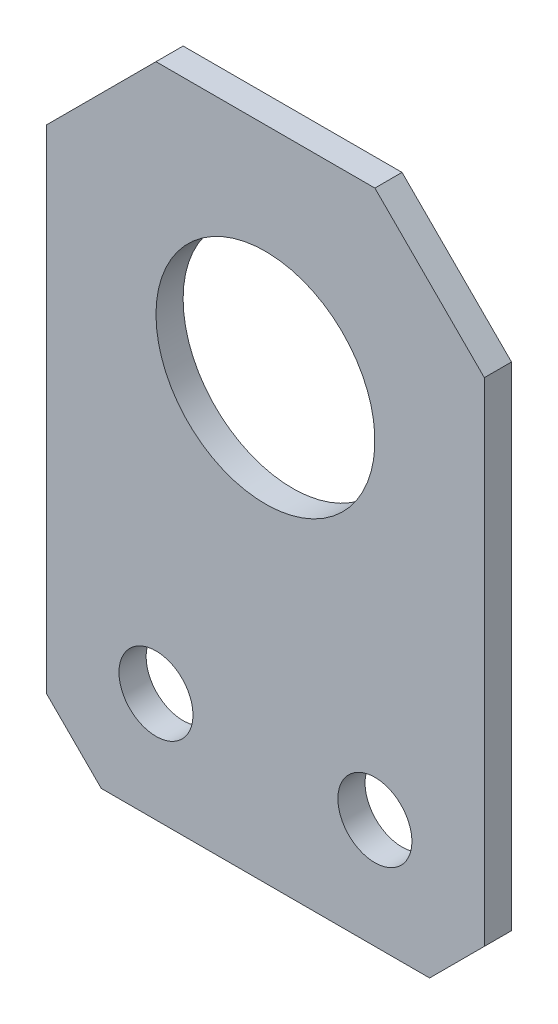
ISO-10303-21;
HEADER;
FILE_DESCRIPTION(('STEP AP214'),'2;1');
FILE_NAME('part.step','',(''),(''),'','','');
FILE_SCHEMA(('AUTOMOTIVE_DESIGN { 1 0 10303 214 1 1 1 1 }'));
ENDSEC;
DATA;
#1=APPLICATION_CONTEXT('core data for automotive mechanical design processes');
#2=APPLICATION_PROTOCOL_DEFINITION('international standard','automotive_design',2000,#1);
#3=PRODUCT_CONTEXT('',#1,'mechanical');
#4=PRODUCT('Part','Part','',(#3));
#5=PRODUCT_RELATED_PRODUCT_CATEGORY('part','',(#4));
#6=PRODUCT_DEFINITION_FORMATION('','',#4);
#7=PRODUCT_DEFINITION_CONTEXT('part definition',#1,'design');
#8=PRODUCT_DEFINITION('design','',#6,#7);
#9=PRODUCT_DEFINITION_SHAPE('','',#8);
#10=(LENGTH_UNIT() NAMED_UNIT(*) SI_UNIT(.MILLI.,.METRE.));
#11=(NAMED_UNIT(*) PLANE_ANGLE_UNIT() SI_UNIT($,.RADIAN.));
#12=(NAMED_UNIT(*) SI_UNIT($,.STERADIAN.) SOLID_ANGLE_UNIT());
#13=UNCERTAINTY_MEASURE_WITH_UNIT(LENGTH_MEASURE(1.E-05),#10,'distance_accuracy_value','');
#14=(GEOMETRIC_REPRESENTATION_CONTEXT(3) GLOBAL_UNCERTAINTY_ASSIGNED_CONTEXT((#13)) GLOBAL_UNIT_ASSIGNED_CONTEXT((#10,
#11,#12)) REPRESENTATION_CONTEXT('',''));
#15=CARTESIAN_POINT('',(0.,0.,0.));
#16=DIRECTION('',(0.,0.,1.));
#17=DIRECTION('',(1.,0.,0.));
#18=AXIS2_PLACEMENT_3D('',#15,#16,#17);
#19=CARTESIAN_POINT('',(-12.7,-25.4,0.));
#20=DIRECTION('',(0.,0.,1.));
#21=DIRECTION('',(1.,0.,0.));
#22=AXIS2_PLACEMENT_3D('',#19,#20,#21);
#23=PLANE('',#22);
#24=CARTESIAN_POINT('',(6.35,-19.05,0.));
#25=DIRECTION('',(0.,0.,-1.));
#26=DIRECTION('',(-1.,0.,0.));
#27=AXIS2_PLACEMENT_3D('',#24,#25,#26);
#28=CIRCLE('',#27,2.1463);
#29=CARTESIAN_POINT('',(4.2037,-19.05,0.));
#30=VERTEX_POINT('',#29);
#31=EDGE_CURVE('E116',#30,#30,#28,.F.);
#32=ORIENTED_EDGE('',*,*,#31,.T.);
#33=EDGE_LOOP('',(#32));
#34=FACE_BOUND('',#33,.T.);
#35=CARTESIAN_POINT('',(0.,0.,0.));
#36=DIRECTION('',(0.,0.,-1.));
#37=DIRECTION('',(-1.,0.,0.));
#38=AXIS2_PLACEMENT_3D('',#35,#36,#37);
#39=CIRCLE('',#38,6.35);
#40=CARTESIAN_POINT('',(-6.35,0.,0.));
#41=VERTEX_POINT('',#40);
#42=EDGE_CURVE('E118',#41,#41,#39,.F.);
#43=ORIENTED_EDGE('',*,*,#42,.T.);
#44=EDGE_LOOP('',(#43));
#45=FACE_BOUND('',#44,.T.);
#46=DIRECTION('',(-0.707106781186549,-0.707106781186546,0.));
#47=VECTOR('',#46,1.);
#48=CARTESIAN_POINT('',(12.7,-22.225,0.));
#49=LINE('',#48,#47);
#50=CARTESIAN_POINT('',(12.7,-22.225,0.));
#51=VERTEX_POINT('',#50);
#52=CARTESIAN_POINT('',(9.52499999999998,-25.4,0.));
#53=VERTEX_POINT('',#52);
#54=EDGE_CURVE('E83',#51,#53,#49,.T.);
#55=ORIENTED_EDGE('',*,*,#54,.T.);
#56=DIRECTION('',(1.,0.,0.));
#57=VECTOR('',#56,1.);
#58=CARTESIAN_POINT('',(-12.7,-25.4,0.));
#59=LINE('',#58,#57);
#60=CARTESIAN_POINT('',(-9.525,-25.4,0.));
#61=VERTEX_POINT('',#60);
#62=EDGE_CURVE('E86',#53,#61,#59,.F.);
#63=ORIENTED_EDGE('',*,*,#62,.T.);
#64=DIRECTION('',(-0.707106781186547,0.707106781186548,0.));
#65=VECTOR('',#64,1.);
#66=CARTESIAN_POINT('',(-9.525,-25.4,0.));
#67=LINE('',#66,#65);
#68=CARTESIAN_POINT('',(-12.7,-22.225,0.));
#69=VERTEX_POINT('',#68);
#70=EDGE_CURVE('E122',#61,#69,#67,.T.);
#71=ORIENTED_EDGE('',*,*,#70,.T.);
#72=DIRECTION('',(0.,1.,0.));
#73=VECTOR('',#72,1.);
#74=CARTESIAN_POINT('',(-12.7,12.7,0.));
#75=LINE('',#74,#73);
#76=CARTESIAN_POINT('',(-12.7,6.35,0.));
#77=VERTEX_POINT('',#76);
#78=EDGE_CURVE('E129',#69,#77,#75,.T.);
#79=ORIENTED_EDGE('',*,*,#78,.T.);
#80=DIRECTION('',(0.707106781186549,0.707106781186546,0.));
#81=VECTOR('',#80,1.);
#82=CARTESIAN_POINT('',(-12.7,6.35,0.));
#83=LINE('',#82,#81);
#84=CARTESIAN_POINT('',(-6.34999999999997,12.7,0.));
#85=VERTEX_POINT('',#84);
#86=EDGE_CURVE('E136',#77,#85,#83,.T.);
#87=ORIENTED_EDGE('',*,*,#86,.T.);
#88=DIRECTION('',(1.,0.,0.));
#89=VECTOR('',#88,1.);
#90=CARTESIAN_POINT('',(-12.7,12.7,0.));
#91=LINE('',#90,#89);
#92=CARTESIAN_POINT('',(6.35,12.7,0.));
#93=VERTEX_POINT('',#92);
#94=EDGE_CURVE('E140',#85,#93,#91,.T.);
#95=ORIENTED_EDGE('',*,*,#94,.T.);
#96=DIRECTION('',(0.707106781186546,-0.707106781186549,0.));
#97=VECTOR('',#96,1.);
#98=CARTESIAN_POINT('',(6.35,12.7,0.));
#99=LINE('',#98,#97);
#100=CARTESIAN_POINT('',(12.7,6.34999999999997,0.));
#101=VERTEX_POINT('',#100);
#102=EDGE_CURVE('E144',#93,#101,#99,.T.);
#103=ORIENTED_EDGE('',*,*,#102,.T.);
#104=DIRECTION('',(0.,-1.,0.));
#105=VECTOR('',#104,1.);
#106=CARTESIAN_POINT('',(12.7,12.7,0.));
#107=LINE('',#106,#105);
#108=EDGE_CURVE('E81',#101,#51,#107,.T.);
#109=ORIENTED_EDGE('',*,*,#108,.T.);
#110=EDGE_LOOP('',(#55,#63,#71,#79,#87,#95,#103,#109));
#111=FACE_BOUND('',#110,.T.);
#112=CARTESIAN_POINT('',(-6.35,-19.05,0.));
#113=DIRECTION('',(0.,0.,-1.));
#114=DIRECTION('',(-1.,0.,0.));
#115=AXIS2_PLACEMENT_3D('',#112,#113,#114);
#116=CIRCLE('',#115,2.1463);
#117=CARTESIAN_POINT('',(-8.4963,-19.05,0.));
#118=VERTEX_POINT('',#117);
#119=EDGE_CURVE('E21',#118,#118,#116,.F.);
#120=ORIENTED_EDGE('',*,*,#119,.T.);
#121=EDGE_LOOP('',(#120));
#122=FACE_BOUND('',#121,.T.);
#123=ADVANCED_FACE('F18',(#34,#45,#111,#122),#23,.F.);
#124=CARTESIAN_POINT('',(-6.35,-19.05,1.5748));
#125=DIRECTION('',(0.,0.,-1.));
#126=DIRECTION('',(-1.,0.,0.));
#127=AXIS2_PLACEMENT_3D('',#124,#125,#126);
#128=CYLINDRICAL_SURFACE('',#127,2.1463);
#129=CARTESIAN_POINT('',(-6.35,-19.05,1.5748));
#130=DIRECTION('',(0.,0.,-1.));
#131=DIRECTION('',(-1.,0.,0.));
#132=AXIS2_PLACEMENT_3D('',#129,#130,#131);
#133=CIRCLE('',#132,2.1463);
#134=CARTESIAN_POINT('',(-8.4963,-19.05,1.5748));
#135=VERTEX_POINT('',#134);
#136=EDGE_CURVE('E112',#135,#135,#133,.T.);
#137=ORIENTED_EDGE('',*,*,#136,.F.);
#138=EDGE_LOOP('',(#137));
#139=FACE_BOUND('',#138,.T.);
#140=ORIENTED_EDGE('',*,*,#119,.F.);
#141=EDGE_LOOP('',(#140));
#142=FACE_BOUND('',#141,.T.);
#143=ADVANCED_FACE('F262',(#139,#142),#128,.F.);
#144=CARTESIAN_POINT('',(-12.7,-25.4,1.5748));
#145=DIRECTION('',(0.,1.,0.));
#146=DIRECTION('',(0.,0.,1.));
#147=AXIS2_PLACEMENT_3D('',#144,#145,#146);
#148=PLANE('',#147);
#149=DIRECTION('',(0.,0.,1.));
#150=VECTOR('',#149,1.);
#151=CARTESIAN_POINT('',(9.52499999999999,-25.4,1.5748));
#152=LINE('',#151,#150);
#153=CARTESIAN_POINT('',(9.52499999999998,-25.4,1.5748));
#154=VERTEX_POINT('',#153);
#155=EDGE_CURVE('E91',#53,#154,#152,.T.);
#156=ORIENTED_EDGE('',*,*,#155,.T.);
#157=DIRECTION('',(1.,0.,0.));
#158=VECTOR('',#157,1.);
#159=CARTESIAN_POINT('',(-12.7,-25.4,1.5748));
#160=LINE('',#159,#158);
#161=CARTESIAN_POINT('',(-9.525,-25.4,1.5748));
#162=VERTEX_POINT('',#161);
#163=EDGE_CURVE('E115',#162,#154,#160,.T.);
#164=ORIENTED_EDGE('',*,*,#163,.F.);
#165=DIRECTION('',(0.,0.,1.));
#166=VECTOR('',#165,1.);
#167=CARTESIAN_POINT('',(-9.525,-25.4,1.5748));
#168=LINE('',#167,#166);
#169=EDGE_CURVE('E97',#162,#61,#168,.F.);
#170=ORIENTED_EDGE('',*,*,#169,.T.);
#171=ORIENTED_EDGE('',*,*,#62,.F.);
#172=EDGE_LOOP('',(#156,#164,#170,#171));
#173=FACE_BOUND('',#172,.T.);
#174=ADVANCED_FACE('F94',(#173),#148,.F.);
#175=CARTESIAN_POINT('',(12.7,-22.225,1.5748));
#176=DIRECTION('',(-0.707106781186546,0.707106781186549,0.));
#177=DIRECTION('',(-0.707106781186549,-0.707106781186546,0.));
#178=AXIS2_PLACEMENT_3D('',#175,#176,#177);
#179=PLANE('',#178);
#180=ORIENTED_EDGE('',*,*,#155,.F.);
#181=ORIENTED_EDGE('',*,*,#54,.F.);
#182=DIRECTION('',(0.,0.,1.));
#183=VECTOR('',#182,1.);
#184=CARTESIAN_POINT('',(12.7,-22.225,1.5748));
#185=LINE('',#184,#183);
#186=CARTESIAN_POINT('',(12.7,-22.225,1.5748));
#187=VERTEX_POINT('',#186);
#188=EDGE_CURVE('E105',#51,#187,#185,.T.);
#189=ORIENTED_EDGE('',*,*,#188,.T.);
#190=DIRECTION('',(0.707106781186549,0.707106781186546,0.));
#191=VECTOR('',#190,1.);
#192=CARTESIAN_POINT('',(9.52499999999998,-25.4,1.5748));
#193=LINE('',#192,#191);
#194=EDGE_CURVE('E102',#154,#187,#193,.T.);
#195=ORIENTED_EDGE('',*,*,#194,.F.);
#196=EDGE_LOOP('',(#180,#181,#189,#195));
#197=FACE_BOUND('',#196,.T.);
#198=ADVANCED_FACE('F100',(#197),#179,.F.);
#199=CARTESIAN_POINT('',(12.7,12.7,1.5748));
#200=DIRECTION('',(-1.,0.,0.));
#201=DIRECTION('',(0.,-1.,0.));
#202=AXIS2_PLACEMENT_3D('',#199,#200,#201);
#203=PLANE('',#202);
#204=ORIENTED_EDGE('',*,*,#188,.F.);
#205=ORIENTED_EDGE('',*,*,#108,.F.);
#206=DIRECTION('',(0.,0.,1.));
#207=VECTOR('',#206,1.);
#208=CARTESIAN_POINT('',(12.7,6.34999999999997,1.5748));
#209=LINE('',#208,#207);
#210=CARTESIAN_POINT('',(12.7,6.34999999999997,1.5748));
#211=VERTEX_POINT('',#210);
#212=EDGE_CURVE('E142',#101,#211,#209,.T.);
#213=ORIENTED_EDGE('',*,*,#212,.T.);
#214=DIRECTION('',(0.,1.,0.));
#215=VECTOR('',#214,1.);
#216=CARTESIAN_POINT('',(12.7,-25.4,1.5748));
#217=LINE('',#216,#215);
#218=EDGE_CURVE('E148',#187,#211,#217,.T.);
#219=ORIENTED_EDGE('',*,*,#218,.F.);
#220=EDGE_LOOP('',(#204,#205,#213,#219));
#221=FACE_BOUND('',#220,.T.);
#222=ADVANCED_FACE('F149',(#221),#203,.F.);
#223=CARTESIAN_POINT('',(6.35,12.7,1.5748));
#224=DIRECTION('',(-0.707106781186549,-0.707106781186546,0.));
#225=DIRECTION('',(0.707106781186546,-0.707106781186549,0.));
#226=AXIS2_PLACEMENT_3D('',#223,#224,#225);
#227=PLANE('',#226);
#228=ORIENTED_EDGE('',*,*,#212,.F.);
#229=ORIENTED_EDGE('',*,*,#102,.F.);
#230=DIRECTION('',(0.,0.,-1.));
#231=VECTOR('',#230,1.);
#232=CARTESIAN_POINT('',(6.35,12.7,1.5748));
#233=LINE('',#232,#231);
#234=CARTESIAN_POINT('',(6.35,12.7,1.5748));
#235=VERTEX_POINT('',#234);
#236=EDGE_CURVE('E138',#93,#235,#233,.F.);
#237=ORIENTED_EDGE('',*,*,#236,.T.);
#238=DIRECTION('',(-0.707106781186546,0.707106781186549,0.));
#239=VECTOR('',#238,1.);
#240=CARTESIAN_POINT('',(12.7,6.34999999999997,1.5748));
#241=LINE('',#240,#239);
#242=EDGE_CURVE('E154',#211,#235,#241,.T.);
#243=ORIENTED_EDGE('',*,*,#242,.F.);
#244=EDGE_LOOP('',(#228,#229,#237,#243));
#245=FACE_BOUND('',#244,.T.);
#246=ADVANCED_FACE('F185',(#245),#227,.F.);
#247=CARTESIAN_POINT('',(-12.7,12.7,1.5748));
#248=DIRECTION('',(0.,-1.,0.));
#249=DIRECTION('',(0.,0.,-1.));
#250=AXIS2_PLACEMENT_3D('',#247,#248,#249);
#251=PLANE('',#250);
#252=ORIENTED_EDGE('',*,*,#236,.F.);
#253=ORIENTED_EDGE('',*,*,#94,.F.);
#254=DIRECTION('',(0.,0.,1.));
#255=VECTOR('',#254,1.);
#256=CARTESIAN_POINT('',(-6.34999999999997,12.7,1.5748));
#257=LINE('',#256,#255);
#258=CARTESIAN_POINT('',(-6.34999999999997,12.7,1.5748));
#259=VERTEX_POINT('',#258);
#260=EDGE_CURVE('E134',#85,#259,#257,.T.);
#261=ORIENTED_EDGE('',*,*,#260,.T.);
#262=DIRECTION('',(1.,0.,0.));
#263=VECTOR('',#262,1.);
#264=CARTESIAN_POINT('',(-12.7,12.7,1.5748));
#265=LINE('',#264,#263);
#266=EDGE_CURVE('E162',#235,#259,#265,.F.);
#267=ORIENTED_EDGE('',*,*,#266,.F.);
#268=EDGE_LOOP('',(#252,#253,#261,#267));
#269=FACE_BOUND('',#268,.T.);
#270=ADVANCED_FACE('F182',(#269),#251,.F.);
#271=CARTESIAN_POINT('',(-12.7,6.35,1.5748));
#272=DIRECTION('',(0.707106781186546,-0.707106781186549,0.));
#273=DIRECTION('',(0.707106781186549,0.707106781186546,0.));
#274=AXIS2_PLACEMENT_3D('',#271,#272,#273);
#275=PLANE('',#274);
#276=ORIENTED_EDGE('',*,*,#260,.F.);
#277=ORIENTED_EDGE('',*,*,#86,.F.);
#278=DIRECTION('',(0.,0.,1.));
#279=VECTOR('',#278,1.);
#280=CARTESIAN_POINT('',(-12.7,6.35,1.5748));
#281=LINE('',#280,#279);
#282=CARTESIAN_POINT('',(-12.7,6.35000000000001,1.5748));
#283=VERTEX_POINT('',#282);
#284=EDGE_CURVE('E132',#77,#283,#281,.T.);
#285=ORIENTED_EDGE('',*,*,#284,.T.);
#286=DIRECTION('',(-0.70710678118655,-0.707106781186545,0.));
#287=VECTOR('',#286,1.);
#288=CARTESIAN_POINT('',(-6.34999999999997,12.7,1.5748));
#289=LINE('',#288,#287);
#290=EDGE_CURVE('E165',#259,#283,#289,.T.);
#291=ORIENTED_EDGE('',*,*,#290,.F.);
#292=EDGE_LOOP('',(#276,#277,#285,#291));
#293=FACE_BOUND('',#292,.T.);
#294=ADVANCED_FACE('F177',(#293),#275,.F.);
#295=CARTESIAN_POINT('',(-12.7,12.7,1.5748));
#296=DIRECTION('',(1.,0.,0.));
#297=DIRECTION('',(0.,1.,0.));
#298=AXIS2_PLACEMENT_3D('',#295,#296,#297);
#299=PLANE('',#298);
#300=DIRECTION('',(0.,0.,1.));
#301=VECTOR('',#300,1.);
#302=CARTESIAN_POINT('',(-12.7,-22.225,1.5748));
#303=LINE('',#302,#301);
#304=CARTESIAN_POINT('',(-12.7,-22.225,1.5748));
#305=VERTEX_POINT('',#304);
#306=EDGE_CURVE('E36',#69,#305,#303,.T.);
#307=ORIENTED_EDGE('',*,*,#306,.T.);
#308=DIRECTION('',(0.,1.,0.));
#309=VECTOR('',#308,1.);
#310=CARTESIAN_POINT('',(-12.7,-25.4,1.5748));
#311=LINE('',#310,#309);
#312=EDGE_CURVE('E168',#283,#305,#311,.F.);
#313=ORIENTED_EDGE('',*,*,#312,.F.);
#314=ORIENTED_EDGE('',*,*,#284,.F.);
#315=ORIENTED_EDGE('',*,*,#78,.F.);
#316=EDGE_LOOP('',(#307,#313,#314,#315));
#317=FACE_BOUND('',#316,.T.);
#318=ADVANCED_FACE('F173',(#317),#299,.F.);
#319=CARTESIAN_POINT('',(-9.525,-25.4,1.5748));
#320=DIRECTION('',(0.707106781186548,0.707106781186547,0.));
#321=DIRECTION('',(-0.707106781186547,0.707106781186548,0.));
#322=AXIS2_PLACEMENT_3D('',#319,#320,#321);
#323=PLANE('',#322);
#324=ORIENTED_EDGE('',*,*,#306,.F.);
#325=ORIENTED_EDGE('',*,*,#70,.F.);
#326=ORIENTED_EDGE('',*,*,#169,.F.);
#327=DIRECTION('',(0.707106781186547,-0.707106781186548,0.));
#328=VECTOR('',#327,1.);
#329=CARTESIAN_POINT('',(-12.7,-22.225,1.5748));
#330=LINE('',#329,#328);
#331=EDGE_CURVE('E111',#305,#162,#330,.T.);
#332=ORIENTED_EDGE('',*,*,#331,.F.);
#333=EDGE_LOOP('',(#324,#325,#326,#332));
#334=FACE_BOUND('',#333,.T.);
#335=ADVANCED_FACE('F171',(#334),#323,.F.);
#336=CARTESIAN_POINT('',(0.,0.,1.5748));
#337=DIRECTION('',(0.,0.,-1.));
#338=DIRECTION('',(-1.,0.,0.));
#339=AXIS2_PLACEMENT_3D('',#336,#337,#338);
#340=CYLINDRICAL_SURFACE('',#339,6.35);
#341=CARTESIAN_POINT('',(0.,0.,1.5748));
#342=DIRECTION('',(0.,0.,-1.));
#343=DIRECTION('',(-1.,0.,0.));
#344=AXIS2_PLACEMENT_3D('',#341,#342,#343);
#345=CIRCLE('',#344,6.35);
#346=CARTESIAN_POINT('',(-6.35,0.,1.5748));
#347=VERTEX_POINT('',#346);
#348=EDGE_CURVE('E27',#347,#347,#345,.T.);
#349=ORIENTED_EDGE('',*,*,#348,.F.);
#350=EDGE_LOOP('',(#349));
#351=FACE_BOUND('',#350,.T.);
#352=ORIENTED_EDGE('',*,*,#42,.F.);
#353=EDGE_LOOP('',(#352));
#354=FACE_BOUND('',#353,.T.);
#355=ADVANCED_FACE('F202',(#351,#354),#340,.F.);
#356=CARTESIAN_POINT('',(6.35,-19.05,1.5748));
#357=DIRECTION('',(0.,0.,-1.));
#358=DIRECTION('',(-1.,0.,0.));
#359=AXIS2_PLACEMENT_3D('',#356,#357,#358);
#360=CYLINDRICAL_SURFACE('',#359,2.1463);
#361=CARTESIAN_POINT('',(6.35,-19.05,1.5748));
#362=DIRECTION('',(0.,0.,-1.));
#363=DIRECTION('',(-1.,0.,0.));
#364=AXIS2_PLACEMENT_3D('',#361,#362,#363);
#365=CIRCLE('',#364,2.1463);
#366=CARTESIAN_POINT('',(4.2037,-19.05,1.5748));
#367=VERTEX_POINT('',#366);
#368=EDGE_CURVE('E11',#367,#367,#365,.T.);
#369=ORIENTED_EDGE('',*,*,#368,.F.);
#370=EDGE_LOOP('',(#369));
#371=FACE_BOUND('',#370,.T.);
#372=ORIENTED_EDGE('',*,*,#31,.F.);
#373=EDGE_LOOP('',(#372));
#374=FACE_BOUND('',#373,.T.);
#375=ADVANCED_FACE('F196',(#371,#374),#360,.F.);
#376=CARTESIAN_POINT('',(-12.7,-25.4,1.5748));
#377=DIRECTION('',(0.,0.,1.));
#378=DIRECTION('',(1.,0.,0.));
#379=AXIS2_PLACEMENT_3D('',#376,#377,#378);
#380=PLANE('',#379);
#381=ORIENTED_EDGE('',*,*,#368,.T.);
#382=EDGE_LOOP('',(#381));
#383=FACE_BOUND('',#382,.T.);
#384=ORIENTED_EDGE('',*,*,#348,.T.);
#385=EDGE_LOOP('',(#384));
#386=FACE_BOUND('',#385,.T.);
#387=ORIENTED_EDGE('',*,*,#312,.T.);
#388=ORIENTED_EDGE('',*,*,#331,.T.);
#389=ORIENTED_EDGE('',*,*,#163,.T.);
#390=ORIENTED_EDGE('',*,*,#194,.T.);
#391=ORIENTED_EDGE('',*,*,#218,.T.);
#392=ORIENTED_EDGE('',*,*,#242,.T.);
#393=ORIENTED_EDGE('',*,*,#266,.T.);
#394=ORIENTED_EDGE('',*,*,#290,.T.);
#395=EDGE_LOOP('',(#387,#388,#389,#390,#391,#392,#393,#394));
#396=FACE_BOUND('',#395,.T.);
#397=ORIENTED_EDGE('',*,*,#136,.T.);
#398=EDGE_LOOP('',(#397));
#399=FACE_BOUND('',#398,.T.);
#400=ADVANCED_FACE('F157',(#383,#386,#396,#399),#380,.T.);
#401=CLOSED_SHELL('',(#123,#143,#174,#198,#222,#246,#270,#294,#318,#335,#355,#375,#400));
#402=MANIFOLD_SOLID_BREP('B1',#401);
#403=ADVANCED_BREP_SHAPE_REPRESENTATION('',(#18,#402),#14);
#404=SHAPE_DEFINITION_REPRESENTATION(#9,#403);
ENDSEC;
END-ISO-10303-21;
